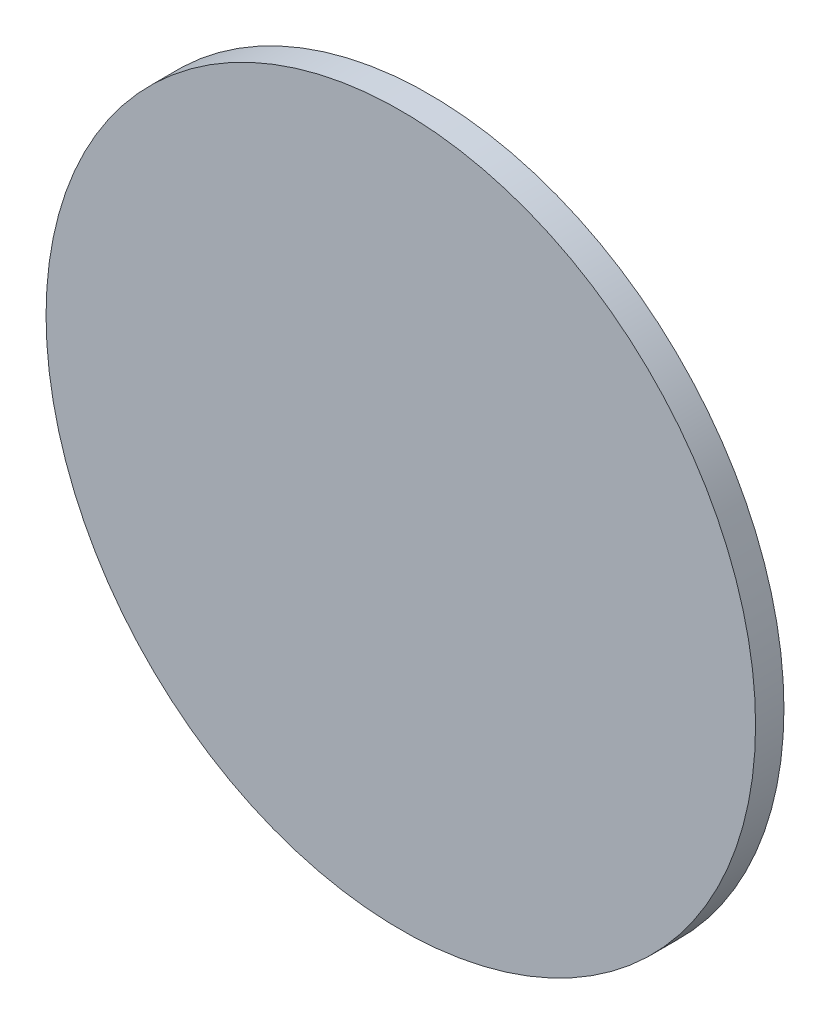
ISO-10303-21;
HEADER;
FILE_DESCRIPTION(('STEP AP214'),'2;1');
FILE_NAME('part.step','',(''),(''),'','','');
FILE_SCHEMA(('AUTOMOTIVE_DESIGN { 1 0 10303 214 1 1 1 1 }'));
ENDSEC;
DATA;
#1=APPLICATION_CONTEXT('core data for automotive mechanical design processes');
#2=APPLICATION_PROTOCOL_DEFINITION('international standard','automotive_design',2000,#1);
#3=PRODUCT_CONTEXT('',#1,'mechanical');
#4=PRODUCT('Part','Part','',(#3));
#5=PRODUCT_RELATED_PRODUCT_CATEGORY('part','',(#4));
#6=PRODUCT_DEFINITION_FORMATION('','',#4);
#7=PRODUCT_DEFINITION_CONTEXT('part definition',#1,'design');
#8=PRODUCT_DEFINITION('design','',#6,#7);
#9=PRODUCT_DEFINITION_SHAPE('','',#8);
#10=(LENGTH_UNIT() NAMED_UNIT(*) SI_UNIT(.MILLI.,.METRE.));
#11=(NAMED_UNIT(*) PLANE_ANGLE_UNIT() SI_UNIT($,.RADIAN.));
#12=(NAMED_UNIT(*) SI_UNIT($,.STERADIAN.) SOLID_ANGLE_UNIT());
#13=UNCERTAINTY_MEASURE_WITH_UNIT(LENGTH_MEASURE(1.E-05),#10,'distance_accuracy_value','');
#14=(GEOMETRIC_REPRESENTATION_CONTEXT(3) GLOBAL_UNCERTAINTY_ASSIGNED_CONTEXT((#13)) GLOBAL_UNIT_ASSIGNED_CONTEXT((#10,
#11,#12)) REPRESENTATION_CONTEXT('',''));
#15=CARTESIAN_POINT('',(0.,0.,0.));
#16=DIRECTION('',(0.,0.,1.));
#17=DIRECTION('',(1.,0.,0.));
#18=AXIS2_PLACEMENT_3D('',#15,#16,#17);
#19=CARTESIAN_POINT('',(0.,0.,1.));
#20=DIRECTION('',(0.,0.,-1.));
#21=DIRECTION('',(-1.,0.,0.));
#22=AXIS2_PLACEMENT_3D('',#19,#20,#21);
#23=CYLINDRICAL_SURFACE('',#22,12.5);
#24=CARTESIAN_POINT('',(0.,0.,1.));
#25=DIRECTION('',(0.,0.,1.));
#26=DIRECTION('',(1.,0.,0.));
#27=AXIS2_PLACEMENT_3D('',#24,#25,#26);
#28=CIRCLE('',#27,12.5);
#29=CARTESIAN_POINT('',(12.5,0.,1.));
#30=VERTEX_POINT('',#29);
#31=EDGE_CURVE('E10',#30,#30,#28,.T.);
#32=ORIENTED_EDGE('',*,*,#31,.F.);
#33=EDGE_LOOP('',(#32));
#34=FACE_BOUND('',#33,.T.);
#35=CARTESIAN_POINT('',(0.,0.,0.));
#36=DIRECTION('',(0.,0.,1.));
#37=DIRECTION('',(1.,0.,0.));
#38=AXIS2_PLACEMENT_3D('',#35,#36,#37);
#39=CIRCLE('',#38,12.5);
#40=CARTESIAN_POINT('',(12.5,0.,0.));
#41=VERTEX_POINT('',#40);
#42=EDGE_CURVE('E38',#41,#41,#39,.T.);
#43=ORIENTED_EDGE('',*,*,#42,.T.);
#44=EDGE_LOOP('',(#43));
#45=FACE_BOUND('',#44,.T.);
#46=ADVANCED_FACE('F35',(#34,#45),#23,.T.);
#47=CARTESIAN_POINT('',(0.,0.,1.));
#48=DIRECTION('',(0.,0.,1.));
#49=DIRECTION('',(1.,0.,0.));
#50=AXIS2_PLACEMENT_3D('',#47,#48,#49);
#51=PLANE('',#50);
#52=ORIENTED_EDGE('',*,*,#31,.T.);
#53=EDGE_LOOP('',(#52));
#54=FACE_BOUND('',#53,.T.);
#55=ADVANCED_FACE('F50',(#54),#51,.T.);
#56=CARTESIAN_POINT('',(0.,0.,0.));
#57=DIRECTION('',(0.,0.,1.));
#58=DIRECTION('',(1.,0.,0.));
#59=AXIS2_PLACEMENT_3D('',#56,#57,#58);
#60=PLANE('',#59);
#61=ORIENTED_EDGE('',*,*,#42,.F.);
#62=EDGE_LOOP('',(#61));
#63=FACE_BOUND('',#62,.T.);
#64=ADVANCED_FACE('F48',(#63),#60,.F.);
#65=CLOSED_SHELL('',(#46,#55,#64));
#66=MANIFOLD_SOLID_BREP('B2',#65);
#67=ADVANCED_BREP_SHAPE_REPRESENTATION('',(#18,#66),#14);
#68=SHAPE_DEFINITION_REPRESENTATION(#9,#67);
ENDSEC;
END-ISO-10303-21;
